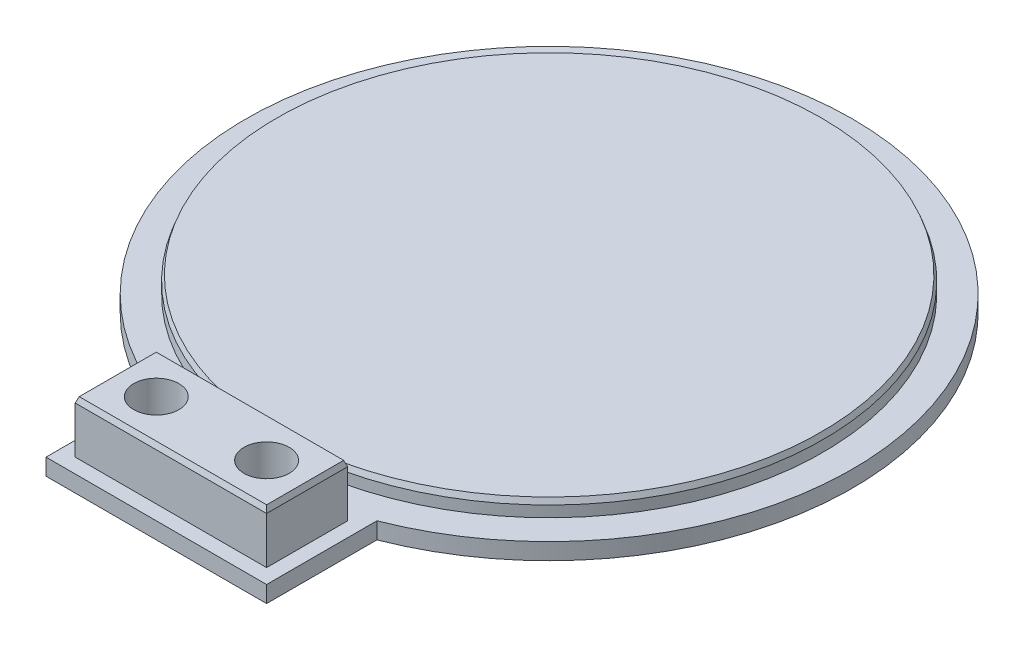
ISO-10303-21;
HEADER;
FILE_DESCRIPTION(('STEP AP214'),'2;1');
FILE_NAME('part.step','',(''),(''),'','','');
FILE_SCHEMA(('AUTOMOTIVE_DESIGN { 1 0 10303 214 1 1 1 1 }'));
ENDSEC;
DATA;
#1=APPLICATION_CONTEXT('core data for automotive mechanical design processes');
#2=APPLICATION_PROTOCOL_DEFINITION('international standard','automotive_design',2000,#1);
#3=PRODUCT_CONTEXT('',#1,'mechanical');
#4=PRODUCT('Part','Part','',(#3));
#5=PRODUCT_RELATED_PRODUCT_CATEGORY('part','',(#4));
#6=PRODUCT_DEFINITION_FORMATION('','',#4);
#7=PRODUCT_DEFINITION_CONTEXT('part definition',#1,'design');
#8=PRODUCT_DEFINITION('design','',#6,#7);
#9=PRODUCT_DEFINITION_SHAPE('','',#8);
#10=(LENGTH_UNIT() NAMED_UNIT(*) SI_UNIT(.MILLI.,.METRE.));
#11=(NAMED_UNIT(*) PLANE_ANGLE_UNIT() SI_UNIT($,.RADIAN.));
#12=(NAMED_UNIT(*) SI_UNIT($,.STERADIAN.) SOLID_ANGLE_UNIT());
#13=UNCERTAINTY_MEASURE_WITH_UNIT(LENGTH_MEASURE(1.E-05),#10,'distance_accuracy_value','');
#14=(GEOMETRIC_REPRESENTATION_CONTEXT(3) GLOBAL_UNCERTAINTY_ASSIGNED_CONTEXT((#13)) GLOBAL_UNIT_ASSIGNED_CONTEXT((#10,
#11,#12)) REPRESENTATION_CONTEXT('',''));
#15=CARTESIAN_POINT('',(0.,0.,0.));
#16=DIRECTION('',(0.,0.,1.));
#17=DIRECTION('',(1.,0.,0.));
#18=AXIS2_PLACEMENT_3D('',#15,#16,#17);
#19=CARTESIAN_POINT('',(0.,3.,0.));
#20=DIRECTION('',(0.,1.,0.));
#21=DIRECTION('',(0.,0.,1.));
#22=AXIS2_PLACEMENT_3D('',#19,#20,#21);
#23=PLANE('',#22);
#24=CARTESIAN_POINT('',(0.,3.,0.));
#25=DIRECTION('',(0.,1.,0.));
#26=DIRECTION('',(0.,0.,1.));
#27=AXIS2_PLACEMENT_3D('',#24,#25,#26);
#28=CIRCLE('',#27,55.);
#29=CARTESIAN_POINT('',(20.,3.,51.234753829798));
#30=VERTEX_POINT('',#29);
#31=CARTESIAN_POINT('',(-20.,3.,51.234753829798));
#32=VERTEX_POINT('',#31);
#33=EDGE_CURVE('E180',#30,#32,#28,.T.);
#34=ORIENTED_EDGE('',*,*,#33,.T.);
#35=DIRECTION('',(0.,0.,-1.));
#36=VECTOR('',#35,1.);
#37=CARTESIAN_POINT('',(-20.,3.,51.234753829798));
#38=LINE('',#37,#36);
#39=CARTESIAN_POINT('',(-20.,3.,71.234753829798));
#40=VERTEX_POINT('',#39);
#41=EDGE_CURVE('E171',#40,#32,#38,.T.);
#42=ORIENTED_EDGE('',*,*,#41,.F.);
#43=DIRECTION('',(-1.,0.,0.));
#44=VECTOR('',#43,1.);
#45=CARTESIAN_POINT('',(-20.,3.,71.234753829798));
#46=LINE('',#45,#44);
#47=CARTESIAN_POINT('',(20.,3.,71.234753829798));
#48=VERTEX_POINT('',#47);
#49=EDGE_CURVE('E157',#48,#40,#46,.T.);
#50=ORIENTED_EDGE('',*,*,#49,.F.);
#51=DIRECTION('',(0.,0.,1.));
#52=VECTOR('',#51,1.);
#53=CARTESIAN_POINT('',(20.,3.,51.234753829798));
#54=LINE('',#53,#52);
#55=EDGE_CURVE('E166',#30,#48,#54,.T.);
#56=ORIENTED_EDGE('',*,*,#55,.F.);
#57=EDGE_LOOP('',(#34,#42,#50,#56));
#58=FACE_BOUND('',#57,.T.);
#59=CARTESIAN_POINT('',(0.,3.,0.));
#60=DIRECTION('',(0.,1.,0.));
#61=DIRECTION('',(0.,0.,1.));
#62=AXIS2_PLACEMENT_3D('',#59,#60,#61);
#63=CIRCLE('',#62,49.7);
#64=CARTESIAN_POINT('',(0.,3.,49.7));
#65=VERTEX_POINT('',#64);
#66=EDGE_CURVE('E121',#65,#65,#63,.T.);
#67=ORIENTED_EDGE('',*,*,#66,.F.);
#68=EDGE_LOOP('',(#67));
#69=FACE_BOUND('',#68,.T.);
#70=DIRECTION('',(1.,0.,0.));
#71=VECTOR('',#70,1.);
#72=CARTESIAN_POINT('',(17.35,3.,68.584753829798));
#73=LINE('',#72,#71);
#74=CARTESIAN_POINT('',(-17.35,3.,68.584753829798));
#75=VERTEX_POINT('',#74);
#76=CARTESIAN_POINT('',(17.35,3.,68.584753829798));
#77=VERTEX_POINT('',#76);
#78=EDGE_CURVE('E117',#75,#77,#73,.T.);
#79=ORIENTED_EDGE('',*,*,#78,.F.);
#80=DIRECTION('',(0.,0.,1.));
#81=VECTOR('',#80,1.);
#82=CARTESIAN_POINT('',(-17.35,3.,68.584753829798));
#83=LINE('',#82,#81);
#84=CARTESIAN_POINT('',(-17.35,3.,53.884753829798));
#85=VERTEX_POINT('',#84);
#86=EDGE_CURVE('E125',#85,#75,#83,.T.);
#87=ORIENTED_EDGE('',*,*,#86,.F.);
#88=DIRECTION('',(-1.,0.,0.));
#89=VECTOR('',#88,1.);
#90=CARTESIAN_POINT('',(17.35,3.,53.884753829798));
#91=LINE('',#90,#89);
#92=CARTESIAN_POINT('',(17.35,3.,53.884753829798));
#93=VERTEX_POINT('',#92);
#94=EDGE_CURVE('E136',#93,#85,#91,.T.);
#95=ORIENTED_EDGE('',*,*,#94,.F.);
#96=DIRECTION('',(0.,0.,-1.));
#97=VECTOR('',#96,1.);
#98=CARTESIAN_POINT('',(17.35,3.,68.584753829798));
#99=LINE('',#98,#97);
#100=EDGE_CURVE('E134',#77,#93,#99,.T.);
#101=ORIENTED_EDGE('',*,*,#100,.F.);
#102=EDGE_LOOP('',(#79,#87,#95,#101));
#103=FACE_BOUND('',#102,.T.);
#104=ADVANCED_FACE('F35',(#58,#69,#103),#23,.T.);
#105=CARTESIAN_POINT('',(0.,3.,0.));
#106=DIRECTION('',(0.,-1.,0.));
#107=DIRECTION('',(0.,0.,-1.));
#108=AXIS2_PLACEMENT_3D('',#105,#106,#107);
#109=CYLINDRICAL_SURFACE('',#108,55.);
#110=CARTESIAN_POINT('',(0.,0.,0.));
#111=DIRECTION('',(0.,1.,0.));
#112=DIRECTION('',(0.,0.,1.));
#113=AXIS2_PLACEMENT_3D('',#110,#111,#112);
#114=CIRCLE('',#113,55.);
#115=CARTESIAN_POINT('',(20.,0.,51.234753829798));
#116=VERTEX_POINT('',#115);
#117=CARTESIAN_POINT('',(-20.,0.,51.234753829798));
#118=VERTEX_POINT('',#117);
#119=EDGE_CURVE('E179',#116,#118,#114,.T.);
#120=ORIENTED_EDGE('',*,*,#119,.T.);
#121=DIRECTION('',(0.,-1.,0.));
#122=VECTOR('',#121,1.);
#123=CARTESIAN_POINT('',(-20.,47.7213595499958,51.234753829798));
#124=LINE('',#123,#122);
#125=EDGE_CURVE('E173',#32,#118,#124,.T.);
#126=ORIENTED_EDGE('',*,*,#125,.F.);
#127=ORIENTED_EDGE('',*,*,#33,.F.);
#128=DIRECTION('',(0.,-1.,0.));
#129=VECTOR('',#128,1.);
#130=CARTESIAN_POINT('',(20.,47.7213595499958,51.234753829798));
#131=LINE('',#130,#129);
#132=EDGE_CURVE('E170',#30,#116,#131,.T.);
#133=ORIENTED_EDGE('',*,*,#132,.T.);
#134=EDGE_LOOP('',(#120,#126,#127,#133));
#135=FACE_BOUND('',#134,.T.);
#136=ADVANCED_FACE('F243',(#135),#109,.T.);
#137=CARTESIAN_POINT('',(0.,0.,0.));
#138=DIRECTION('',(0.,1.,0.));
#139=DIRECTION('',(0.,0.,1.));
#140=AXIS2_PLACEMENT_3D('',#137,#138,#139);
#141=PLANE('',#140);
#142=CARTESIAN_POINT('',(9.99999999999999,0.,61.234753829798));
#143=DIRECTION('',(0.,1.,0.));
#144=DIRECTION('',(0.,0.,1.));
#145=AXIS2_PLACEMENT_3D('',#142,#143,#144);
#146=CIRCLE('',#145,4.1);
#147=CARTESIAN_POINT('',(9.99999999999999,0.,65.334753829798));
#148=VERTEX_POINT('',#147);
#149=EDGE_CURVE('E147',#148,#148,#146,.T.);
#150=ORIENTED_EDGE('',*,*,#149,.T.);
#151=EDGE_LOOP('',(#150));
#152=FACE_BOUND('',#151,.T.);
#153=CARTESIAN_POINT('',(-10.,0.,61.234753829798));
#154=DIRECTION('',(0.,1.,0.));
#155=DIRECTION('',(0.,0.,1.));
#156=AXIS2_PLACEMENT_3D('',#153,#154,#155);
#157=CIRCLE('',#156,4.1);
#158=CARTESIAN_POINT('',(-10.,0.,65.334753829798));
#159=VERTEX_POINT('',#158);
#160=EDGE_CURVE('E150',#159,#159,#157,.T.);
#161=ORIENTED_EDGE('',*,*,#160,.T.);
#162=EDGE_LOOP('',(#161));
#163=FACE_BOUND('',#162,.T.);
#164=ORIENTED_EDGE('',*,*,#119,.F.);
#165=DIRECTION('',(0.,0.,1.));
#166=VECTOR('',#165,1.);
#167=CARTESIAN_POINT('',(20.,0.,51.234753829798));
#168=LINE('',#167,#166);
#169=CARTESIAN_POINT('',(20.,0.,71.234753829798));
#170=VERTEX_POINT('',#169);
#171=EDGE_CURVE('E153',#116,#170,#168,.T.);
#172=ORIENTED_EDGE('',*,*,#171,.T.);
#173=DIRECTION('',(-1.,0.,0.));
#174=VECTOR('',#173,1.);
#175=CARTESIAN_POINT('',(-20.,0.,71.234753829798));
#176=LINE('',#175,#174);
#177=CARTESIAN_POINT('',(-20.,0.,71.234753829798));
#178=VERTEX_POINT('',#177);
#179=EDGE_CURVE('E158',#170,#178,#176,.T.);
#180=ORIENTED_EDGE('',*,*,#179,.T.);
#181=DIRECTION('',(0.,0.,-1.));
#182=VECTOR('',#181,1.);
#183=CARTESIAN_POINT('',(-20.,0.,51.234753829798));
#184=LINE('',#183,#182);
#185=EDGE_CURVE('E154',#178,#118,#184,.T.);
#186=ORIENTED_EDGE('',*,*,#185,.T.);
#187=EDGE_LOOP('',(#164,#172,#180,#186));
#188=FACE_BOUND('',#187,.T.);
#189=ADVANCED_FACE('F251',(#152,#163,#188),#141,.F.);
#190=CARTESIAN_POINT('',(-20.,47.7213595499958,71.234753829798));
#191=DIRECTION('',(0.,0.,1.));
#192=DIRECTION('',(1.,0.,0.));
#193=AXIS2_PLACEMENT_3D('',#190,#191,#192);
#194=PLANE('',#193);
#195=DIRECTION('',(0.,-1.,0.));
#196=VECTOR('',#195,1.);
#197=CARTESIAN_POINT('',(20.,47.7213595499958,71.234753829798));
#198=LINE('',#197,#196);
#199=EDGE_CURVE('E169',#48,#170,#198,.T.);
#200=ORIENTED_EDGE('',*,*,#199,.F.);
#201=ORIENTED_EDGE('',*,*,#49,.T.);
#202=DIRECTION('',(0.,-1.,0.));
#203=VECTOR('',#202,1.);
#204=CARTESIAN_POINT('',(-20.,47.7213595499958,71.234753829798));
#205=LINE('',#204,#203);
#206=EDGE_CURVE('E165',#40,#178,#205,.T.);
#207=ORIENTED_EDGE('',*,*,#206,.T.);
#208=ORIENTED_EDGE('',*,*,#179,.F.);
#209=EDGE_LOOP('',(#200,#201,#207,#208));
#210=FACE_BOUND('',#209,.T.);
#211=ADVANCED_FACE('F257',(#210),#194,.T.);
#212=CARTESIAN_POINT('',(-20.,47.7213595499958,51.234753829798));
#213=DIRECTION('',(-1.,0.,0.));
#214=DIRECTION('',(0.,0.,1.));
#215=AXIS2_PLACEMENT_3D('',#212,#213,#214);
#216=PLANE('',#215);
#217=ORIENTED_EDGE('',*,*,#206,.F.);
#218=ORIENTED_EDGE('',*,*,#41,.T.);
#219=ORIENTED_EDGE('',*,*,#125,.T.);
#220=ORIENTED_EDGE('',*,*,#185,.F.);
#221=EDGE_LOOP('',(#217,#218,#219,#220));
#222=FACE_BOUND('',#221,.T.);
#223=ADVANCED_FACE('F307',(#222),#216,.T.);
#224=CARTESIAN_POINT('',(20.,47.7213595499958,51.234753829798));
#225=DIRECTION('',(1.,0.,0.));
#226=DIRECTION('',(0.,0.,-1.));
#227=AXIS2_PLACEMENT_3D('',#224,#225,#226);
#228=PLANE('',#227);
#229=ORIENTED_EDGE('',*,*,#132,.F.);
#230=ORIENTED_EDGE('',*,*,#55,.T.);
#231=ORIENTED_EDGE('',*,*,#199,.T.);
#232=ORIENTED_EDGE('',*,*,#171,.F.);
#233=EDGE_LOOP('',(#229,#230,#231,#232));
#234=FACE_BOUND('',#233,.T.);
#235=ADVANCED_FACE('F304',(#234),#228,.T.);
#236=CARTESIAN_POINT('',(-10.,0.,61.234753829798));
#237=DIRECTION('',(0.,1.,0.));
#238=DIRECTION('',(0.,0.,1.));
#239=AXIS2_PLACEMENT_3D('',#236,#237,#238);
#240=CYLINDRICAL_SURFACE('',#239,4.1);
#241=ORIENTED_EDGE('',*,*,#160,.F.);
#242=EDGE_LOOP('',(#241));
#243=FACE_BOUND('',#242,.T.);
#244=CARTESIAN_POINT('',(-10.,12.5,61.234753829798));
#245=DIRECTION('',(0.,1.,0.));
#246=DIRECTION('',(0.,0.,1.));
#247=AXIS2_PLACEMENT_3D('',#244,#245,#246);
#248=CIRCLE('',#247,4.1);
#249=CARTESIAN_POINT('',(-10.,12.5,65.334753829798));
#250=VERTEX_POINT('',#249);
#251=EDGE_CURVE('E131',#250,#250,#248,.T.);
#252=ORIENTED_EDGE('',*,*,#251,.T.);
#253=EDGE_LOOP('',(#252));
#254=FACE_BOUND('',#253,.T.);
#255=ADVANCED_FACE('F225',(#243,#254),#240,.F.);
#256=CARTESIAN_POINT('',(9.99999999999999,0.,61.234753829798));
#257=DIRECTION('',(0.,1.,0.));
#258=DIRECTION('',(0.,0.,1.));
#259=AXIS2_PLACEMENT_3D('',#256,#257,#258);
#260=CYLINDRICAL_SURFACE('',#259,4.1);
#261=ORIENTED_EDGE('',*,*,#149,.F.);
#262=EDGE_LOOP('',(#261));
#263=FACE_BOUND('',#262,.T.);
#264=CARTESIAN_POINT('',(9.99999999999999,12.5,61.234753829798));
#265=DIRECTION('',(0.,1.,0.));
#266=DIRECTION('',(0.,0.,1.));
#267=AXIS2_PLACEMENT_3D('',#264,#265,#266);
#268=CIRCLE('',#267,4.1);
#269=CARTESIAN_POINT('',(9.99999999999999,12.5,65.334753829798));
#270=VERTEX_POINT('',#269);
#271=EDGE_CURVE('E214',#270,#270,#268,.T.);
#272=ORIENTED_EDGE('',*,*,#271,.T.);
#273=EDGE_LOOP('',(#272));
#274=FACE_BOUND('',#273,.T.);
#275=ADVANCED_FACE('F297',(#263,#274),#260,.F.);
#276=CARTESIAN_POINT('',(0.,6.,0.));
#277=DIRECTION('',(0.,-1.,0.));
#278=DIRECTION('',(0.,0.,-1.));
#279=AXIS2_PLACEMENT_3D('',#276,#277,#278);
#280=CYLINDRICAL_SURFACE('',#279,49.7);
#281=CARTESIAN_POINT('',(0.,5.00000000000011,0.));
#282=DIRECTION('',(0.,1.,0.));
#283=DIRECTION('',(0.,0.,1.));
#284=AXIS2_PLACEMENT_3D('',#281,#282,#283);
#285=CIRCLE('',#284,49.7);
#286=CARTESIAN_POINT('',(0.,5.00000000000011,49.7));
#287=VERTEX_POINT('',#286);
#288=EDGE_CURVE('E188',#287,#287,#285,.F.);
#289=ORIENTED_EDGE('',*,*,#288,.T.);
#290=EDGE_LOOP('',(#289));
#291=FACE_BOUND('',#290,.T.);
#292=ORIENTED_EDGE('',*,*,#66,.T.);
#293=EDGE_LOOP('',(#292));
#294=FACE_BOUND('',#293,.T.);
#295=ADVANCED_FACE('F293',(#291,#294),#280,.T.);
#296=CARTESIAN_POINT('',(0.,6.,0.));
#297=DIRECTION('',(0.,1.,0.));
#298=DIRECTION('',(0.,0.,1.));
#299=AXIS2_PLACEMENT_3D('',#296,#297,#298);
#300=PLANE('',#299);
#301=CARTESIAN_POINT('',(0.,6.,0.));
#302=DIRECTION('',(0.,1.,0.));
#303=DIRECTION('',(0.,0.,1.));
#304=AXIS2_PLACEMENT_3D('',#301,#302,#303);
#305=CIRCLE('',#304,49.3360297657339);
#306=CARTESIAN_POINT('',(0.,6.,49.3360297657339));
#307=VERTEX_POINT('',#306);
#308=EDGE_CURVE('E183',#307,#307,#305,.T.);
#309=ORIENTED_EDGE('',*,*,#308,.T.);
#310=EDGE_LOOP('',(#309));
#311=FACE_BOUND('',#310,.T.);
#312=ADVANCED_FACE('F238',(#311),#300,.T.);
#313=CARTESIAN_POINT('',(0.,6.,0.));
#314=DIRECTION('',(0.,-1.,0.));
#315=DIRECTION('',(0.,0.,-1.));
#316=AXIS2_PLACEMENT_3D('',#313,#314,#315);
#317=CONICAL_SURFACE('',#316,49.3360297657339,0.349065850398864);
#318=ORIENTED_EDGE('',*,*,#288,.F.);
#319=EDGE_LOOP('',(#318));
#320=FACE_BOUND('',#319,.T.);
#321=ORIENTED_EDGE('',*,*,#308,.F.);
#322=EDGE_LOOP('',(#321));
#323=FACE_BOUND('',#322,.T.);
#324=ADVANCED_FACE('F230',(#320,#323),#317,.T.);
#325=CARTESIAN_POINT('',(0.,12.5,0.));
#326=DIRECTION('',(0.,1.,0.));
#327=DIRECTION('',(0.,0.,1.));
#328=AXIS2_PLACEMENT_3D('',#325,#326,#327);
#329=PLANE('',#328);
#330=DIRECTION('',(0.,0.,1.));
#331=VECTOR('',#330,1.);
#332=CARTESIAN_POINT('',(-16.9860297657338,12.5,68.584753829798));
#333=LINE('',#332,#331);
#334=CARTESIAN_POINT('',(-16.9860297657338,12.5,54.2487240640642));
#335=VERTEX_POINT('',#334);
#336=CARTESIAN_POINT('',(-16.9860297657338,12.5,68.2207835955318));
#337=VERTEX_POINT('',#336);
#338=EDGE_CURVE('E191',#335,#337,#333,.T.);
#339=ORIENTED_EDGE('',*,*,#338,.T.);
#340=DIRECTION('',(1.,0.,0.));
#341=VECTOR('',#340,1.);
#342=CARTESIAN_POINT('',(17.35,12.5,68.2207835955318));
#343=LINE('',#342,#341);
#344=CARTESIAN_POINT('',(16.9860297657338,12.5,68.2207835955318));
#345=VERTEX_POINT('',#344);
#346=EDGE_CURVE('E197',#337,#345,#343,.T.);
#347=ORIENTED_EDGE('',*,*,#346,.T.);
#348=DIRECTION('',(0.,0.,-1.));
#349=VECTOR('',#348,1.);
#350=CARTESIAN_POINT('',(16.9860297657338,12.5,53.884753829798));
#351=LINE('',#350,#349);
#352=CARTESIAN_POINT('',(16.9860297657338,12.5,54.2487240640642));
#353=VERTEX_POINT('',#352);
#354=EDGE_CURVE('E195',#345,#353,#351,.T.);
#355=ORIENTED_EDGE('',*,*,#354,.T.);
#356=DIRECTION('',(-1.,0.,0.));
#357=VECTOR('',#356,1.);
#358=CARTESIAN_POINT('',(-17.35,12.5,54.2487240640642));
#359=LINE('',#358,#357);
#360=EDGE_CURVE('E193',#353,#335,#359,.T.);
#361=ORIENTED_EDGE('',*,*,#360,.T.);
#362=EDGE_LOOP('',(#339,#347,#355,#361));
#363=FACE_BOUND('',#362,.T.);
#364=ORIENTED_EDGE('',*,*,#251,.F.);
#365=EDGE_LOOP('',(#364));
#366=FACE_BOUND('',#365,.T.);
#367=ORIENTED_EDGE('',*,*,#271,.F.);
#368=EDGE_LOOP('',(#367));
#369=FACE_BOUND('',#368,.T.);
#370=ADVANCED_FACE('F227',(#363,#366,#369),#329,.T.);
#371=CARTESIAN_POINT('',(-17.35,12.5,68.584753829798));
#372=DIRECTION('',(1.,0.,0.));
#373=DIRECTION('',(0.,0.,-1.));
#374=AXIS2_PLACEMENT_3D('',#371,#372,#373);
#375=PLANE('',#374);
#376=DIRECTION('',(0.,-1.,0.));
#377=VECTOR('',#376,1.);
#378=CARTESIAN_POINT('',(-17.35,12.5,68.584753829798));
#379=LINE('',#378,#377);
#380=CARTESIAN_POINT('',(-17.35,11.5,68.584753829798));
#381=VERTEX_POINT('',#380);
#382=EDGE_CURVE('E112',#381,#75,#379,.T.);
#383=ORIENTED_EDGE('',*,*,#382,.F.);
#384=DIRECTION('',(0.,0.,-1.));
#385=VECTOR('',#384,1.);
#386=CARTESIAN_POINT('',(-17.35,11.5,53.884753829798));
#387=LINE('',#386,#385);
#388=CARTESIAN_POINT('',(-17.35,11.5,53.884753829798));
#389=VERTEX_POINT('',#388);
#390=EDGE_CURVE('E11',#381,#389,#387,.T.);
#391=ORIENTED_EDGE('',*,*,#390,.T.);
#392=DIRECTION('',(0.,-1.,0.));
#393=VECTOR('',#392,1.);
#394=CARTESIAN_POINT('',(-17.35,12.5,53.884753829798));
#395=LINE('',#394,#393);
#396=EDGE_CURVE('E127',#389,#85,#395,.T.);
#397=ORIENTED_EDGE('',*,*,#396,.T.);
#398=ORIENTED_EDGE('',*,*,#86,.T.);
#399=EDGE_LOOP('',(#383,#391,#397,#398));
#400=FACE_BOUND('',#399,.T.);
#401=ADVANCED_FACE('F126',(#400),#375,.F.);
#402=CARTESIAN_POINT('',(17.35,12.5,68.584753829798));
#403=DIRECTION('',(0.,0.,-1.));
#404=DIRECTION('',(-1.,0.,0.));
#405=AXIS2_PLACEMENT_3D('',#402,#403,#404);
#406=PLANE('',#405);
#407=DIRECTION('',(0.,-1.,0.));
#408=VECTOR('',#407,1.);
#409=CARTESIAN_POINT('',(17.35,12.5,68.584753829798));
#410=LINE('',#409,#408);
#411=CARTESIAN_POINT('',(17.35,11.5,68.584753829798));
#412=VERTEX_POINT('',#411);
#413=EDGE_CURVE('E122',#412,#77,#410,.T.);
#414=ORIENTED_EDGE('',*,*,#413,.F.);
#415=DIRECTION('',(-1.,0.,0.));
#416=VECTOR('',#415,1.);
#417=CARTESIAN_POINT('',(-17.35,11.5,68.584753829798));
#418=LINE('',#417,#416);
#419=EDGE_CURVE('E120',#412,#381,#418,.T.);
#420=ORIENTED_EDGE('',*,*,#419,.T.);
#421=ORIENTED_EDGE('',*,*,#382,.T.);
#422=ORIENTED_EDGE('',*,*,#78,.T.);
#423=EDGE_LOOP('',(#414,#420,#421,#422));
#424=FACE_BOUND('',#423,.T.);
#425=ADVANCED_FACE('F115',(#424),#406,.F.);
#426=CARTESIAN_POINT('',(17.35,12.5,68.584753829798));
#427=DIRECTION('',(-1.,0.,0.));
#428=DIRECTION('',(0.,0.,1.));
#429=AXIS2_PLACEMENT_3D('',#426,#427,#428);
#430=PLANE('',#429);
#431=DIRECTION('',(0.,-1.,0.));
#432=VECTOR('',#431,1.);
#433=CARTESIAN_POINT('',(17.35,12.5,53.884753829798));
#434=LINE('',#433,#432);
#435=CARTESIAN_POINT('',(17.35,11.5,53.884753829798));
#436=VERTEX_POINT('',#435);
#437=EDGE_CURVE('E142',#436,#93,#434,.T.);
#438=ORIENTED_EDGE('',*,*,#437,.F.);
#439=DIRECTION('',(0.,0.,1.));
#440=VECTOR('',#439,1.);
#441=CARTESIAN_POINT('',(17.35,11.5,68.584753829798));
#442=LINE('',#441,#440);
#443=EDGE_CURVE('E201',#436,#412,#442,.T.);
#444=ORIENTED_EDGE('',*,*,#443,.T.);
#445=ORIENTED_EDGE('',*,*,#413,.T.);
#446=ORIENTED_EDGE('',*,*,#100,.T.);
#447=EDGE_LOOP('',(#438,#444,#445,#446));
#448=FACE_BOUND('',#447,.T.);
#449=ADVANCED_FACE('F278',(#448),#430,.F.);
#450=CARTESIAN_POINT('',(17.35,12.5,53.884753829798));
#451=DIRECTION('',(0.,0.,1.));
#452=DIRECTION('',(1.,0.,0.));
#453=AXIS2_PLACEMENT_3D('',#450,#451,#452);
#454=PLANE('',#453);
#455=ORIENTED_EDGE('',*,*,#396,.F.);
#456=DIRECTION('',(1.,0.,0.));
#457=VECTOR('',#456,1.);
#458=CARTESIAN_POINT('',(17.35,11.5,53.884753829798));
#459=LINE('',#458,#457);
#460=EDGE_CURVE('E44',#389,#436,#459,.T.);
#461=ORIENTED_EDGE('',*,*,#460,.T.);
#462=ORIENTED_EDGE('',*,*,#437,.T.);
#463=ORIENTED_EDGE('',*,*,#94,.T.);
#464=EDGE_LOOP('',(#455,#461,#462,#463));
#465=FACE_BOUND('',#464,.T.);
#466=ADVANCED_FACE('F273',(#465),#454,.F.);
#467=CARTESIAN_POINT('',(0.,12.5,54.2487240640642));
#468=DIRECTION('',(0.,0.342020143325665,-0.93969262078591));
#469=DIRECTION('',(1.,0.,0.));
#470=AXIS2_PLACEMENT_3D('',#467,#468,#469);
#471=PLANE('',#470);
#472=DIRECTION('',(0.323615577118181,-0.889126490715991,-0.323615577118182));
#473=VECTOR('',#472,1.);
#474=CARTESIAN_POINT('',(15.207133117231,17.3874783733049,56.027620712567));
#475=LINE('',#474,#473);
#476=EDGE_CURVE('E207',#436,#353,#475,.F.);
#477=ORIENTED_EDGE('',*,*,#476,.F.);
#478=ORIENTED_EDGE('',*,*,#460,.F.);
#479=DIRECTION('',(-0.323615577118182,-0.88912649071599,-0.323615577118182));
#480=VECTOR('',#479,1.);
#481=CARTESIAN_POINT('',(-22.667338155867,-3.10926651484921,48.567415673931));
#482=LINE('',#481,#480);
#483=EDGE_CURVE('E39',#335,#389,#482,.T.);
#484=ORIENTED_EDGE('',*,*,#483,.F.);
#485=ORIENTED_EDGE('',*,*,#360,.F.);
#486=EDGE_LOOP('',(#477,#478,#484,#485));
#487=FACE_BOUND('',#486,.T.);
#488=ADVANCED_FACE('F37',(#487),#471,.T.);
#489=CARTESIAN_POINT('',(-16.9860297657338,12.5,0.));
#490=DIRECTION('',(-0.93969262078591,0.342020143325665,0.));
#491=DIRECTION('',(0.,0.,-1.));
#492=AXIS2_PLACEMENT_3D('',#489,#490,#491);
#493=PLANE('',#492);
#494=ORIENTED_EDGE('',*,*,#483,.T.);
#495=ORIENTED_EDGE('',*,*,#390,.F.);
#496=DIRECTION('',(0.323615577118182,0.88912649071599,-0.323615577118182));
#497=VECTOR('',#496,1.);
#498=CARTESIAN_POINT('',(-9.84146891366575,32.1295196129767,61.0762227434637));
#499=LINE('',#498,#497);
#500=EDGE_CURVE('E206',#337,#381,#499,.F.);
#501=ORIENTED_EDGE('',*,*,#500,.F.);
#502=ORIENTED_EDGE('',*,*,#338,.F.);
#503=EDGE_LOOP('',(#494,#495,#501,#502));
#504=FACE_BOUND('',#503,.T.);
#505=ADVANCED_FACE('F268',(#504),#493,.T.);
#506=CARTESIAN_POINT('',(16.9860297657338,12.5,0.));
#507=DIRECTION('',(0.93969262078591,0.342020143325664,0.));
#508=DIRECTION('',(0.,0.,1.));
#509=AXIS2_PLACEMENT_3D('',#506,#507,#508);
#510=PLANE('',#509);
#511=ORIENTED_EDGE('',*,*,#476,.T.);
#512=ORIENTED_EDGE('',*,*,#354,.F.);
#513=DIRECTION('',(0.323615577118181,-0.889126490715991,0.323615577118182));
#514=VECTOR('',#513,1.);
#515=CARTESIAN_POINT('',(9.84146891366574,32.1295196129767,61.0762227434637));
#516=LINE('',#515,#514);
#517=EDGE_CURVE('E204',#412,#345,#516,.F.);
#518=ORIENTED_EDGE('',*,*,#517,.F.);
#519=ORIENTED_EDGE('',*,*,#443,.F.);
#520=EDGE_LOOP('',(#511,#512,#518,#519));
#521=FACE_BOUND('',#520,.T.);
#522=ADVANCED_FACE('F265',(#521),#510,.T.);
#523=CARTESIAN_POINT('',(0.,12.5,68.2207835955318));
#524=DIRECTION('',(0.,0.342020143325665,0.93969262078591));
#525=DIRECTION('',(-1.,0.,0.));
#526=AXIS2_PLACEMENT_3D('',#523,#524,#525);
#527=PLANE('',#526);
#528=ORIENTED_EDGE('',*,*,#500,.T.);
#529=ORIENTED_EDGE('',*,*,#419,.F.);
#530=ORIENTED_EDGE('',*,*,#517,.T.);
#531=ORIENTED_EDGE('',*,*,#346,.F.);
#532=EDGE_LOOP('',(#528,#529,#530,#531));
#533=FACE_BOUND('',#532,.T.);
#534=ADVANCED_FACE('F262',(#533),#527,.T.);
#535=CLOSED_SHELL('',(#104,#136,#189,#211,#223,#235,#255,#275,#295,#312,#324,#370,#401,#425,
#449,#466,#488,#505,#522,#534));
#536=MANIFOLD_SOLID_BREP('B2',#535);
#537=ADVANCED_BREP_SHAPE_REPRESENTATION('',(#18,#536),#14);
#538=SHAPE_DEFINITION_REPRESENTATION(#9,#537);
ENDSEC;
END-ISO-10303-21;
